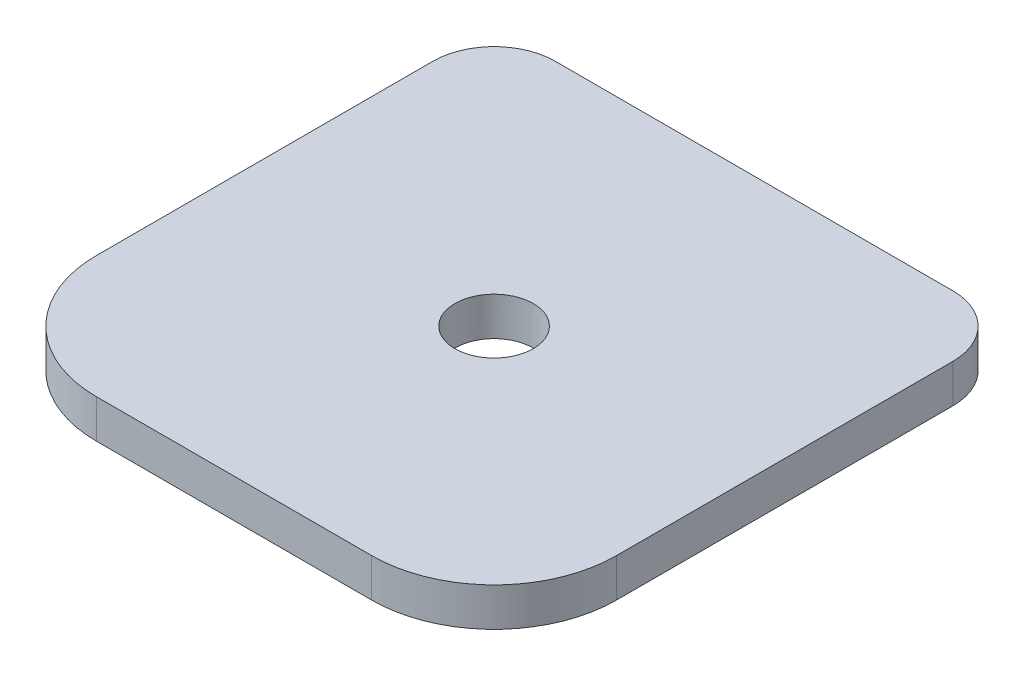
ISO-10303-21;
HEADER;
FILE_DESCRIPTION(('STEP AP214'),'2;1');
FILE_NAME('part.step','',(''),(''),'','','');
FILE_SCHEMA(('AUTOMOTIVE_DESIGN { 1 0 10303 214 1 1 1 1 }'));
ENDSEC;
DATA;
#1=APPLICATION_CONTEXT('core data for automotive mechanical design processes');
#2=APPLICATION_PROTOCOL_DEFINITION('international standard','automotive_design',2000,#1);
#3=PRODUCT_CONTEXT('',#1,'mechanical');
#4=PRODUCT('Part','Part','',(#3));
#5=PRODUCT_RELATED_PRODUCT_CATEGORY('part','',(#4));
#6=PRODUCT_DEFINITION_FORMATION('','',#4);
#7=PRODUCT_DEFINITION_CONTEXT('part definition',#1,'design');
#8=PRODUCT_DEFINITION('design','',#6,#7);
#9=PRODUCT_DEFINITION_SHAPE('','',#8);
#10=(LENGTH_UNIT() NAMED_UNIT(*) SI_UNIT(.MILLI.,.METRE.));
#11=(NAMED_UNIT(*) PLANE_ANGLE_UNIT() SI_UNIT($,.RADIAN.));
#12=(NAMED_UNIT(*) SI_UNIT($,.STERADIAN.) SOLID_ANGLE_UNIT());
#13=UNCERTAINTY_MEASURE_WITH_UNIT(LENGTH_MEASURE(1.E-05),#10,'distance_accuracy_value','');
#14=(GEOMETRIC_REPRESENTATION_CONTEXT(3) GLOBAL_UNCERTAINTY_ASSIGNED_CONTEXT((#13)) GLOBAL_UNIT_ASSIGNED_CONTEXT((#10,
#11,#12)) REPRESENTATION_CONTEXT('',''));
#15=CARTESIAN_POINT('',(0.,0.,0.));
#16=DIRECTION('',(0.,0.,1.));
#17=DIRECTION('',(1.,0.,0.));
#18=AXIS2_PLACEMENT_3D('',#15,#16,#17);
#19=CARTESIAN_POINT('',(0.,6.3,0.));
#20=DIRECTION('',(1.,0.,0.));
#21=DIRECTION('',(0.,0.,-1.));
#22=AXIS2_PLACEMENT_3D('',#19,#20,#21);
#23=PLANE('',#22);
#24=DIRECTION('',(0.,0.,1.));
#25=VECTOR('',#24,1.);
#26=CARTESIAN_POINT('',(0.,0.,0.));
#27=LINE('',#26,#25);
#28=CARTESIAN_POINT('',(0.,0.,-75.));
#29=VERTEX_POINT('',#28);
#30=CARTESIAN_POINT('',(0.,0.,-20.));
#31=VERTEX_POINT('',#30);
#32=EDGE_CURVE('E168',#29,#31,#27,.T.);
#33=ORIENTED_EDGE('',*,*,#32,.T.);
#34=DIRECTION('',(0.,-1.,0.));
#35=VECTOR('',#34,1.);
#36=CARTESIAN_POINT('',(0.,6.3,-20.));
#37=LINE('',#36,#35);
#38=CARTESIAN_POINT('',(0.,6.3,-20.));
#39=VERTEX_POINT('',#38);
#40=EDGE_CURVE('E56',#31,#39,#37,.F.);
#41=ORIENTED_EDGE('',*,*,#40,.T.);
#42=DIRECTION('',(0.,0.,1.));
#43=VECTOR('',#42,1.);
#44=CARTESIAN_POINT('',(0.,6.3,0.));
#45=LINE('',#44,#43);
#46=CARTESIAN_POINT('',(0.,6.3,-75.));
#47=VERTEX_POINT('',#46);
#48=EDGE_CURVE('E127',#47,#39,#45,.T.);
#49=ORIENTED_EDGE('',*,*,#48,.F.);
#50=DIRECTION('',(0.,-1.,0.));
#51=VECTOR('',#50,1.);
#52=CARTESIAN_POINT('',(0.,6.3,-75.));
#53=LINE('',#52,#51);
#54=EDGE_CURVE('E143',#47,#29,#53,.T.);
#55=ORIENTED_EDGE('',*,*,#54,.T.);
#56=EDGE_LOOP('',(#33,#41,#49,#55));
#57=FACE_BOUND('',#56,.T.);
#58=ADVANCED_FACE('F33',(#57),#23,.F.);
#59=CARTESIAN_POINT('',(0.,6.3,0.));
#60=DIRECTION('',(0.,0.,-1.));
#61=DIRECTION('',(-1.,0.,0.));
#62=AXIS2_PLACEMENT_3D('',#59,#60,#61);
#63=PLANE('',#62);
#64=DIRECTION('',(1.,0.,0.));
#65=VECTOR('',#64,1.);
#66=CARTESIAN_POINT('',(0.,6.3,0.));
#67=LINE('',#66,#65);
#68=CARTESIAN_POINT('',(20.,6.3,0.));
#69=VERTEX_POINT('',#68);
#70=CARTESIAN_POINT('',(65.,6.3,0.));
#71=VERTEX_POINT('',#70);
#72=EDGE_CURVE('E130',#69,#71,#67,.T.);
#73=ORIENTED_EDGE('',*,*,#72,.F.);
#74=DIRECTION('',(0.,-1.,0.));
#75=VECTOR('',#74,1.);
#76=CARTESIAN_POINT('',(20.,6.3,0.));
#77=LINE('',#76,#75);
#78=CARTESIAN_POINT('',(20.,0.,0.));
#79=VERTEX_POINT('',#78);
#80=EDGE_CURVE('E148',#69,#79,#77,.T.);
#81=ORIENTED_EDGE('',*,*,#80,.T.);
#82=DIRECTION('',(1.,0.,0.));
#83=VECTOR('',#82,1.);
#84=CARTESIAN_POINT('',(0.,0.,0.));
#85=LINE('',#84,#83);
#86=CARTESIAN_POINT('',(65.,0.,0.));
#87=VERTEX_POINT('',#86);
#88=EDGE_CURVE('E132',#79,#87,#85,.T.);
#89=ORIENTED_EDGE('',*,*,#88,.T.);
#90=DIRECTION('',(0.,-1.,0.));
#91=VECTOR('',#90,1.);
#92=CARTESIAN_POINT('',(65.,6.3,0.));
#93=LINE('',#92,#91);
#94=EDGE_CURVE('E146',#87,#71,#93,.F.);
#95=ORIENTED_EDGE('',*,*,#94,.T.);
#96=EDGE_LOOP('',(#73,#81,#89,#95));
#97=FACE_BOUND('',#96,.T.);
#98=ADVANCED_FACE('F162',(#97),#63,.F.);
#99=CARTESIAN_POINT('',(85.,6.3,0.));
#100=DIRECTION('',(-1.,0.,0.));
#101=DIRECTION('',(0.,0.,1.));
#102=AXIS2_PLACEMENT_3D('',#99,#100,#101);
#103=PLANE('',#102);
#104=DIRECTION('',(0.,0.,-1.));
#105=VECTOR('',#104,1.);
#106=CARTESIAN_POINT('',(85.,6.3,0.));
#107=LINE('',#106,#105);
#108=CARTESIAN_POINT('',(85.,6.3,-20.));
#109=VERTEX_POINT('',#108);
#110=CARTESIAN_POINT('',(85.,6.3,-75.));
#111=VERTEX_POINT('',#110);
#112=EDGE_CURVE('E165',#109,#111,#107,.T.);
#113=ORIENTED_EDGE('',*,*,#112,.F.);
#114=DIRECTION('',(0.,-1.,0.));
#115=VECTOR('',#114,1.);
#116=CARTESIAN_POINT('',(85.,6.3,-20.));
#117=LINE('',#116,#115);
#118=CARTESIAN_POINT('',(85.,0.,-20.));
#119=VERTEX_POINT('',#118);
#120=EDGE_CURVE('E11',#109,#119,#117,.T.);
#121=ORIENTED_EDGE('',*,*,#120,.T.);
#122=DIRECTION('',(0.,0.,-1.));
#123=VECTOR('',#122,1.);
#124=CARTESIAN_POINT('',(85.,0.,0.));
#125=LINE('',#124,#123);
#126=CARTESIAN_POINT('',(85.,0.,-75.));
#127=VERTEX_POINT('',#126);
#128=EDGE_CURVE('E128',#119,#127,#125,.T.);
#129=ORIENTED_EDGE('',*,*,#128,.T.);
#130=DIRECTION('',(0.,-1.,0.));
#131=VECTOR('',#130,1.);
#132=CARTESIAN_POINT('',(85.,6.3,-75.));
#133=LINE('',#132,#131);
#134=EDGE_CURVE('E108',#127,#111,#133,.F.);
#135=ORIENTED_EDGE('',*,*,#134,.T.);
#136=EDGE_LOOP('',(#113,#121,#129,#135));
#137=FACE_BOUND('',#136,.T.);
#138=ADVANCED_FACE('F195',(#137),#103,.F.);
#139=CARTESIAN_POINT('',(0.,6.3,-85.));
#140=DIRECTION('',(0.,0.,1.));
#141=DIRECTION('',(1.,0.,0.));
#142=AXIS2_PLACEMENT_3D('',#139,#140,#141);
#143=PLANE('',#142);
#144=DIRECTION('',(-1.,0.,0.));
#145=VECTOR('',#144,1.);
#146=CARTESIAN_POINT('',(0.,6.3,-85.));
#147=LINE('',#146,#145);
#148=CARTESIAN_POINT('',(75.,6.3,-85.));
#149=VERTEX_POINT('',#148);
#150=CARTESIAN_POINT('',(10.,6.3,-85.));
#151=VERTEX_POINT('',#150);
#152=EDGE_CURVE('E121',#149,#151,#147,.T.);
#153=ORIENTED_EDGE('',*,*,#152,.F.);
#154=DIRECTION('',(0.,-1.,0.));
#155=VECTOR('',#154,1.);
#156=CARTESIAN_POINT('',(75.,6.3,-85.));
#157=LINE('',#156,#155);
#158=CARTESIAN_POINT('',(75.,0.,-85.));
#159=VERTEX_POINT('',#158);
#160=EDGE_CURVE('E106',#149,#159,#157,.T.);
#161=ORIENTED_EDGE('',*,*,#160,.T.);
#162=DIRECTION('',(-1.,0.,0.));
#163=VECTOR('',#162,1.);
#164=CARTESIAN_POINT('',(0.,0.,-85.));
#165=LINE('',#164,#163);
#166=CARTESIAN_POINT('',(10.,0.,-85.));
#167=VERTEX_POINT('',#166);
#168=EDGE_CURVE('E118',#159,#167,#165,.T.);
#169=ORIENTED_EDGE('',*,*,#168,.T.);
#170=DIRECTION('',(0.,-1.,0.));
#171=VECTOR('',#170,1.);
#172=CARTESIAN_POINT('',(10.,6.3,-85.));
#173=LINE('',#172,#171);
#174=EDGE_CURVE('E122',#167,#151,#173,.F.);
#175=ORIENTED_EDGE('',*,*,#174,.T.);
#176=EDGE_LOOP('',(#153,#161,#169,#175));
#177=FACE_BOUND('',#176,.T.);
#178=ADVANCED_FACE('F117',(#177),#143,.F.);
#179=CARTESIAN_POINT('',(0.,6.3,0.));
#180=DIRECTION('',(0.,-1.,0.));
#181=DIRECTION('',(0.,0.,-1.));
#182=AXIS2_PLACEMENT_3D('',#179,#180,#181);
#183=PLANE('',#182);
#184=CARTESIAN_POINT('',(42.5,6.3,-42.5));
#185=DIRECTION('',(0.,1.,0.));
#186=DIRECTION('',(0.,0.,1.));
#187=AXIS2_PLACEMENT_3D('',#184,#185,#186);
#188=CIRCLE('',#187,6.4);
#189=CARTESIAN_POINT('',(42.5,6.3,-36.1));
#190=VERTEX_POINT('',#189);
#191=EDGE_CURVE('E170',#190,#190,#188,.T.);
#192=ORIENTED_EDGE('',*,*,#191,.F.);
#193=EDGE_LOOP('',(#192));
#194=FACE_BOUND('',#193,.T.);
#195=ORIENTED_EDGE('',*,*,#48,.T.);
#196=CARTESIAN_POINT('',(20.,6.3,-20.));
#197=DIRECTION('',(0.,-1.,0.));
#198=DIRECTION('',(0.,0.,-1.));
#199=AXIS2_PLACEMENT_3D('',#196,#197,#198);
#200=CIRCLE('',#199,20.);
#201=EDGE_CURVE('E41',#39,#69,#200,.F.);
#202=ORIENTED_EDGE('',*,*,#201,.T.);
#203=ORIENTED_EDGE('',*,*,#72,.T.);
#204=CARTESIAN_POINT('',(65.,6.3,-20.));
#205=DIRECTION('',(0.,-1.,0.));
#206=DIRECTION('',(0.,0.,-1.));
#207=AXIS2_PLACEMENT_3D('',#204,#205,#206);
#208=CIRCLE('',#207,20.);
#209=EDGE_CURVE('E48',#71,#109,#208,.F.);
#210=ORIENTED_EDGE('',*,*,#209,.T.);
#211=ORIENTED_EDGE('',*,*,#112,.T.);
#212=CARTESIAN_POINT('',(75.,6.3,-75.));
#213=DIRECTION('',(0.,-1.,0.));
#214=DIRECTION('',(0.,0.,-1.));
#215=AXIS2_PLACEMENT_3D('',#212,#213,#214);
#216=CIRCLE('',#215,10.);
#217=EDGE_CURVE('E141',#111,#149,#216,.F.);
#218=ORIENTED_EDGE('',*,*,#217,.T.);
#219=ORIENTED_EDGE('',*,*,#152,.T.);
#220=CARTESIAN_POINT('',(10.,6.3,-75.));
#221=DIRECTION('',(0.,-1.,0.));
#222=DIRECTION('',(0.,0.,-1.));
#223=AXIS2_PLACEMENT_3D('',#220,#221,#222);
#224=CIRCLE('',#223,10.);
#225=EDGE_CURVE('E139',#151,#47,#224,.F.);
#226=ORIENTED_EDGE('',*,*,#225,.T.);
#227=EDGE_LOOP('',(#195,#202,#203,#210,#211,#218,#219,#226));
#228=FACE_BOUND('',#227,.T.);
#229=ADVANCED_FACE('F158',(#194,#228),#183,.F.);
#230=CARTESIAN_POINT('',(0.,0.,0.));
#231=DIRECTION('',(0.,-1.,0.));
#232=DIRECTION('',(0.,0.,-1.));
#233=AXIS2_PLACEMENT_3D('',#230,#231,#232);
#234=PLANE('',#233);
#235=CARTESIAN_POINT('',(42.5,0.,-42.5));
#236=DIRECTION('',(0.,-1.,0.));
#237=DIRECTION('',(0.,0.,-1.));
#238=AXIS2_PLACEMENT_3D('',#235,#236,#237);
#239=CIRCLE('',#238,6.4);
#240=CARTESIAN_POINT('',(42.5,0.,-48.9));
#241=VERTEX_POINT('',#240);
#242=EDGE_CURVE('E173',#241,#241,#239,.F.);
#243=ORIENTED_EDGE('',*,*,#242,.T.);
#244=EDGE_LOOP('',(#243));
#245=FACE_BOUND('',#244,.T.);
#246=ORIENTED_EDGE('',*,*,#88,.F.);
#247=CARTESIAN_POINT('',(20.,0.,-20.));
#248=DIRECTION('',(0.,-1.,0.));
#249=DIRECTION('',(0.,0.,-1.));
#250=AXIS2_PLACEMENT_3D('',#247,#248,#249);
#251=CIRCLE('',#250,20.);
#252=EDGE_CURVE('E153',#79,#31,#251,.T.);
#253=ORIENTED_EDGE('',*,*,#252,.T.);
#254=ORIENTED_EDGE('',*,*,#32,.F.);
#255=CARTESIAN_POINT('',(10.,0.,-75.));
#256=DIRECTION('',(0.,-1.,0.));
#257=DIRECTION('',(0.,0.,-1.));
#258=AXIS2_PLACEMENT_3D('',#255,#256,#257);
#259=CIRCLE('',#258,10.);
#260=EDGE_CURVE('E112',#29,#167,#259,.T.);
#261=ORIENTED_EDGE('',*,*,#260,.T.);
#262=ORIENTED_EDGE('',*,*,#168,.F.);
#263=CARTESIAN_POINT('',(75.,0.,-75.));
#264=DIRECTION('',(0.,-1.,0.));
#265=DIRECTION('',(0.,0.,-1.));
#266=AXIS2_PLACEMENT_3D('',#263,#264,#265);
#267=CIRCLE('',#266,10.);
#268=EDGE_CURVE('E102',#159,#127,#267,.T.);
#269=ORIENTED_EDGE('',*,*,#268,.T.);
#270=ORIENTED_EDGE('',*,*,#128,.F.);
#271=CARTESIAN_POINT('',(65.,0.,-20.));
#272=DIRECTION('',(0.,-1.,0.));
#273=DIRECTION('',(0.,0.,-1.));
#274=AXIS2_PLACEMENT_3D('',#271,#272,#273);
#275=CIRCLE('',#274,20.);
#276=EDGE_CURVE('E151',#119,#87,#275,.T.);
#277=ORIENTED_EDGE('',*,*,#276,.T.);
#278=EDGE_LOOP('',(#246,#253,#254,#261,#262,#269,#270,#277));
#279=FACE_BOUND('',#278,.T.);
#280=ADVANCED_FACE('F125',(#245,#279),#234,.T.);
#281=CARTESIAN_POINT('',(42.5,-0.00100000000000013,-42.5));
#282=DIRECTION('',(0.,1.,0.));
#283=DIRECTION('',(0.,0.,1.));
#284=AXIS2_PLACEMENT_3D('',#281,#282,#283);
#285=CYLINDRICAL_SURFACE('',#284,6.4);
#286=ORIENTED_EDGE('',*,*,#242,.F.);
#287=EDGE_LOOP('',(#286));
#288=FACE_BOUND('',#287,.T.);
#289=ORIENTED_EDGE('',*,*,#191,.T.);
#290=EDGE_LOOP('',(#289));
#291=FACE_BOUND('',#290,.T.);
#292=ADVANCED_FACE('F182',(#288,#291),#285,.F.);
#293=CARTESIAN_POINT('',(75.,6.3,-75.));
#294=DIRECTION('',(0.,-1.,0.));
#295=DIRECTION('',(0.,0.,-1.));
#296=AXIS2_PLACEMENT_3D('',#293,#294,#295);
#297=CYLINDRICAL_SURFACE('',#296,10.);
#298=ORIENTED_EDGE('',*,*,#217,.F.);
#299=ORIENTED_EDGE('',*,*,#134,.F.);
#300=ORIENTED_EDGE('',*,*,#268,.F.);
#301=ORIENTED_EDGE('',*,*,#160,.F.);
#302=EDGE_LOOP('',(#298,#299,#300,#301));
#303=FACE_BOUND('',#302,.T.);
#304=ADVANCED_FACE('F105',(#303),#297,.T.);
#305=CARTESIAN_POINT('',(10.,6.3,-75.));
#306=DIRECTION('',(0.,-1.,0.));
#307=DIRECTION('',(0.,0.,-1.));
#308=AXIS2_PLACEMENT_3D('',#305,#306,#307);
#309=CYLINDRICAL_SURFACE('',#308,10.);
#310=ORIENTED_EDGE('',*,*,#225,.F.);
#311=ORIENTED_EDGE('',*,*,#174,.F.);
#312=ORIENTED_EDGE('',*,*,#260,.F.);
#313=ORIENTED_EDGE('',*,*,#54,.F.);
#314=EDGE_LOOP('',(#310,#311,#312,#313));
#315=FACE_BOUND('',#314,.T.);
#316=ADVANCED_FACE('F207',(#315),#309,.T.);
#317=CARTESIAN_POINT('',(20.,6.3,-20.));
#318=DIRECTION('',(0.,-1.,0.));
#319=DIRECTION('',(0.,0.,-1.));
#320=AXIS2_PLACEMENT_3D('',#317,#318,#319);
#321=CYLINDRICAL_SURFACE('',#320,20.);
#322=ORIENTED_EDGE('',*,*,#201,.F.);
#323=ORIENTED_EDGE('',*,*,#40,.F.);
#324=ORIENTED_EDGE('',*,*,#252,.F.);
#325=ORIENTED_EDGE('',*,*,#80,.F.);
#326=EDGE_LOOP('',(#322,#323,#324,#325));
#327=FACE_BOUND('',#326,.T.);
#328=ADVANCED_FACE('F167',(#327),#321,.T.);
#329=CARTESIAN_POINT('',(65.,6.3,-20.));
#330=DIRECTION('',(0.,-1.,0.));
#331=DIRECTION('',(0.,0.,-1.));
#332=AXIS2_PLACEMENT_3D('',#329,#330,#331);
#333=CYLINDRICAL_SURFACE('',#332,20.);
#334=ORIENTED_EDGE('',*,*,#209,.F.);
#335=ORIENTED_EDGE('',*,*,#94,.F.);
#336=ORIENTED_EDGE('',*,*,#276,.F.);
#337=ORIENTED_EDGE('',*,*,#120,.F.);
#338=EDGE_LOOP('',(#334,#335,#336,#337));
#339=FACE_BOUND('',#338,.T.);
#340=ADVANCED_FACE('F35',(#339),#333,.T.);
#341=CLOSED_SHELL('',(#58,#98,#138,#178,#229,#280,#292,#304,#316,#328,#340));
#342=MANIFOLD_SOLID_BREP('B2',#341);
#343=ADVANCED_BREP_SHAPE_REPRESENTATION('',(#18,#342),#14);
#344=SHAPE_DEFINITION_REPRESENTATION(#9,#343);
ENDSEC;
END-ISO-10303-21;
